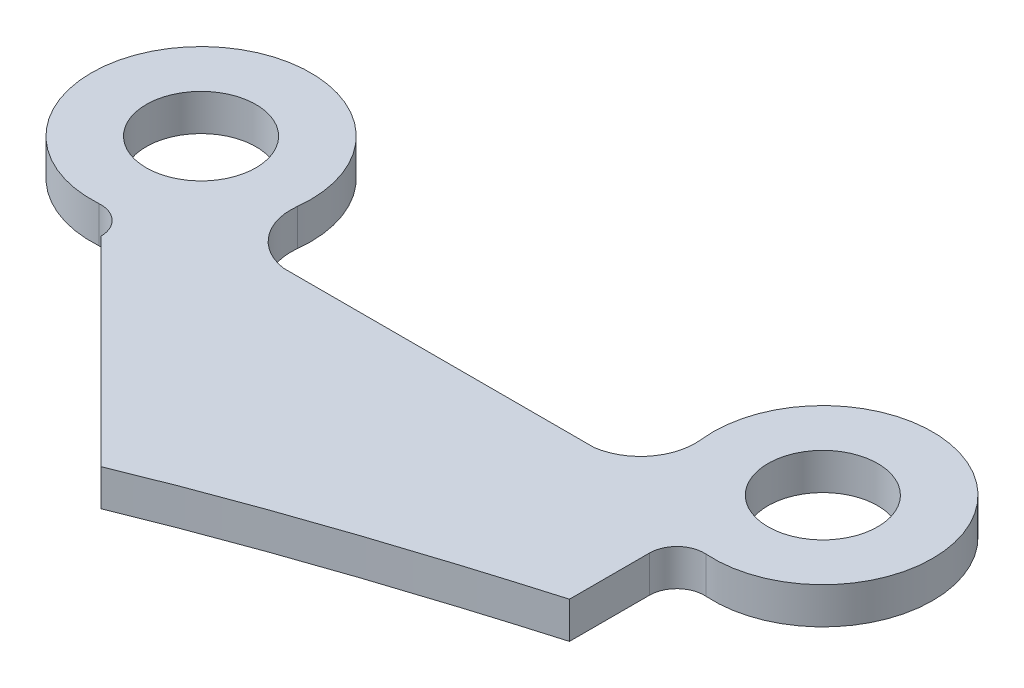
ISO-10303-21;
HEADER;
FILE_DESCRIPTION(('STEP AP214'),'2;1');
FILE_NAME('part.step','',(''),(''),'','','');
FILE_SCHEMA(('AUTOMOTIVE_DESIGN { 1 0 10303 214 1 1 1 1 }'));
ENDSEC;
DATA;
#1=APPLICATION_CONTEXT('core data for automotive mechanical design processes');
#2=APPLICATION_PROTOCOL_DEFINITION('international standard','automotive_design',2000,#1);
#3=PRODUCT_CONTEXT('',#1,'mechanical');
#4=PRODUCT('Part','Part','',(#3));
#5=PRODUCT_RELATED_PRODUCT_CATEGORY('part','',(#4));
#6=PRODUCT_DEFINITION_FORMATION('','',#4);
#7=PRODUCT_DEFINITION_CONTEXT('part definition',#1,'design');
#8=PRODUCT_DEFINITION('design','',#6,#7);
#9=PRODUCT_DEFINITION_SHAPE('','',#8);
#10=(LENGTH_UNIT() NAMED_UNIT(*) SI_UNIT(.MILLI.,.METRE.));
#11=(NAMED_UNIT(*) PLANE_ANGLE_UNIT() SI_UNIT($,.RADIAN.));
#12=(NAMED_UNIT(*) SI_UNIT($,.STERADIAN.) SOLID_ANGLE_UNIT());
#13=UNCERTAINTY_MEASURE_WITH_UNIT(LENGTH_MEASURE(1.E-05),#10,'distance_accuracy_value','');
#14=(GEOMETRIC_REPRESENTATION_CONTEXT(3) GLOBAL_UNCERTAINTY_ASSIGNED_CONTEXT((#13)) GLOBAL_UNIT_ASSIGNED_CONTEXT((#10,
#11,#12)) REPRESENTATION_CONTEXT('',''));
#15=CARTESIAN_POINT('',(0.,0.,0.));
#16=DIRECTION('',(0.,0.,1.));
#17=DIRECTION('',(1.,0.,0.));
#18=AXIS2_PLACEMENT_3D('',#15,#16,#17);
#19=CARTESIAN_POINT('',(1003.5,-336.43981096134,-430.79991693377));
#20=DIRECTION('',(0.,-1.,0.));
#21=DIRECTION('',(0.,0.,1.));
#22=AXIS2_PLACEMENT_3D('',#19,#20,#21);
#23=PLANE('',#22);
#24=CARTESIAN_POINT('',(1003.,-336.43981096134,-438.283231707318));
#25=DIRECTION('',(0.,1.,0.));
#26=DIRECTION('',(0.,0.,1.));
#27=AXIS2_PLACEMENT_3D('',#24,#25,#26);
#28=CIRCLE('',#27,2.99999999999994);
#29=CARTESIAN_POINT('',(1003.,-336.43981096134,-435.283231707318));
#30=VERTEX_POINT('',#29);
#31=EDGE_CURVE('E190',#30,#30,#28,.T.);
#32=ORIENTED_EDGE('',*,*,#31,.T.);
#33=EDGE_LOOP('',(#32));
#34=FACE_BOUND('',#33,.T.);
#35=CARTESIAN_POINT('',(1003.5,-336.43981096134,-430.79991693377));
#36=DIRECTION('',(0.,1.,0.));
#37=DIRECTION('',(0.,0.,1.));
#38=AXIS2_PLACEMENT_3D('',#35,#36,#37);
#39=CIRCLE('',#38,1.5);
#40=CARTESIAN_POINT('',(1005.,-336.43981096134,-430.79991693377));
#41=VERTEX_POINT('',#40);
#42=CARTESIAN_POINT('',(1003.4,-336.43981096134,-432.29657988848));
#43=VERTEX_POINT('',#42);
#44=EDGE_CURVE('E177',#41,#43,#39,.T.);
#45=ORIENTED_EDGE('',*,*,#44,.T.);
#46=CARTESIAN_POINT('',(1003.,-336.43981096134,-438.283231707318));
#47=DIRECTION('',(0.,1.,0.));
#48=DIRECTION('',(0.,0.,1.));
#49=AXIS2_PLACEMENT_3D('',#46,#47,#48);
#50=CIRCLE('',#49,6.00000000000004);
#51=CARTESIAN_POINT('',(1008.96038354779,-336.43981096134,-437.594880079705));
#52=VERTEX_POINT('',#51);
#53=EDGE_CURVE('E174',#52,#43,#50,.T.);
#54=ORIENTED_EDGE('',*,*,#53,.F.);
#55=CARTESIAN_POINT('',(1011.94057532168,-336.43981096134,-437.250704265898));
#56=DIRECTION('',(0.,1.,0.));
#57=DIRECTION('',(0.,0.,1.));
#58=AXIS2_PLACEMENT_3D('',#55,#56,#57);
#59=CIRCLE('',#58,2.99999999999996);
#60=CARTESIAN_POINT('',(1011.5,-336.43981096134,-434.283231707318));
#61=VERTEX_POINT('',#60);
#62=EDGE_CURVE('E170',#52,#61,#59,.T.);
#63=ORIENTED_EDGE('',*,*,#62,.T.);
#64=DIRECTION('',(-1.,0.,0.));
#65=VECTOR('',#64,1.);
#66=CARTESIAN_POINT('',(1028.5,-336.43981096134,-434.283231707318));
#67=LINE('',#66,#65);
#68=CARTESIAN_POINT('',(1028.5,-336.43981096134,-434.283231707318));
#69=VERTEX_POINT('',#68);
#70=EDGE_CURVE('E166',#69,#61,#67,.T.);
#71=ORIENTED_EDGE('',*,*,#70,.F.);
#72=CARTESIAN_POINT('',(1028.05942467832,-336.43981096134,-437.250704265898));
#73=DIRECTION('',(0.,1.,0.));
#74=DIRECTION('',(0.,0.,1.));
#75=AXIS2_PLACEMENT_3D('',#72,#73,#74);
#76=CIRCLE('',#75,2.99999999999996);
#77=CARTESIAN_POINT('',(1031.03961645221,-336.43981096134,-437.594880079705));
#78=VERTEX_POINT('',#77);
#79=EDGE_CURVE('E162',#69,#78,#76,.T.);
#80=ORIENTED_EDGE('',*,*,#79,.T.);
#81=CARTESIAN_POINT('',(1037.,-336.43981096134,-438.283231707318));
#82=DIRECTION('',(0.,1.,0.));
#83=DIRECTION('',(0.,0.,1.));
#84=AXIS2_PLACEMENT_3D('',#81,#82,#83);
#85=CIRCLE('',#84,5.99999999999999);
#86=CARTESIAN_POINT('',(1036.6,-336.43981096134,-432.29657988848));
#87=VERTEX_POINT('',#86);
#88=EDGE_CURVE('E143',#87,#78,#85,.T.);
#89=ORIENTED_EDGE('',*,*,#88,.F.);
#90=CARTESIAN_POINT('',(1036.5,-336.43981096134,-430.79991693377));
#91=DIRECTION('',(0.,1.,0.));
#92=DIRECTION('',(0.,0.,1.));
#93=AXIS2_PLACEMENT_3D('',#90,#91,#92);
#94=CIRCLE('',#93,1.50000000000005);
#95=CARTESIAN_POINT('',(1035.,-336.43981096134,-430.79991693377));
#96=VERTEX_POINT('',#95);
#97=EDGE_CURVE('E141',#87,#96,#94,.T.);
#98=ORIENTED_EDGE('',*,*,#97,.T.);
#99=DIRECTION('',(0.,0.,-1.));
#100=VECTOR('',#99,1.);
#101=CARTESIAN_POINT('',(1035.,-336.43981096134,-430.712849211409));
#102=LINE('',#101,#100);
#103=CARTESIAN_POINT('',(1034.99999999986,-336.43981096134,-426.4272406204));
#104=VERTEX_POINT('',#103);
#105=EDGE_CURVE('E123',#104,#96,#102,.T.);
#106=ORIENTED_EDGE('',*,*,#105,.F.);
#107=CARTESIAN_POINT('',(1015.90379797933,-336.43981096134,-419.896118954461));
#108=CARTESIAN_POINT('',(1021.18574672281,-336.43981096134,-422.066519939314));
#109=CARTESIAN_POINT('',(1027.58904483357,-336.43981096134,-424.27172398807));
#110=CARTESIAN_POINT('',(1034.99999999986,-336.43981096134,-426.4272406204));
#111=(BOUNDED_CURVE() B_SPLINE_CURVE(3,(#107,#108,#109,#110),.UNSPECIFIED.,.F.,
.F.) B_SPLINE_CURVE_WITH_KNOTS((4,4),(0.141934854100476,0.193423321701997),
.UNSPECIFIED.) CURVE() GEOMETRIC_REPRESENTATION_ITEM() RATIONAL_B_SPLINE_CURVE((0.593424606066283,
0.56374935932761,0.54114361204481,0.525607364217886)) REPRESENTATION_ITEM(''));
#112=CARTESIAN_POINT('',(1015.90379797932,-336.43981096134,-419.896118954459));
#113=VERTEX_POINT('',#112);
#114=EDGE_CURVE('E132',#113,#104,#111,.T.);
#115=ORIENTED_EDGE('',*,*,#114,.F.);
#116=DIRECTION('',(0.707106781186916,0.,0.707106781186179));
#117=VECTOR('',#116,1.);
#118=CARTESIAN_POINT('',(1005.,-336.43981096134,-430.79991693377));
#119=LINE('',#118,#117);
#120=EDGE_CURVE('E135',#41,#113,#119,.T.);
#121=ORIENTED_EDGE('',*,*,#120,.F.);
#122=EDGE_LOOP('',(#45,#54,#63,#71,#80,#89,#98,#106,#115,#121));
#123=FACE_BOUND('',#122,.T.);
#124=CARTESIAN_POINT('',(1037.,-336.43981096134,-438.283231707318));
#125=DIRECTION('',(0.,1.,0.));
#126=DIRECTION('',(0.,0.,1.));
#127=AXIS2_PLACEMENT_3D('',#124,#125,#126);
#128=CIRCLE('',#127,2.99999999999994);
#129=CARTESIAN_POINT('',(1037.,-336.43981096134,-435.283231707318));
#130=VERTEX_POINT('',#129);
#131=EDGE_CURVE('E293',#130,#130,#128,.T.);
#132=ORIENTED_EDGE('',*,*,#131,.T.);
#133=EDGE_LOOP('',(#132));
#134=FACE_BOUND('',#133,.T.);
#135=ADVANCED_FACE('F40',(#34,#123,#134),#23,.T.);
#136=CARTESIAN_POINT('',(1003.5,-334.43981096134,-430.79991693377));
#137=DIRECTION('',(0.,-1.,0.));
#138=DIRECTION('',(0.,0.,1.));
#139=AXIS2_PLACEMENT_3D('',#136,#137,#138);
#140=PLANE('',#139);
#141=CARTESIAN_POINT('',(1003.5,-334.43981096134,-430.79991693377));
#142=DIRECTION('',(0.,1.,0.));
#143=DIRECTION('',(0.,0.,1.));
#144=AXIS2_PLACEMENT_3D('',#141,#142,#143);
#145=CIRCLE('',#144,1.5);
#146=CARTESIAN_POINT('',(1005.,-334.43981096134,-430.79991693377));
#147=VERTEX_POINT('',#146);
#148=CARTESIAN_POINT('',(1003.4,-334.43981096134,-432.29657988848));
#149=VERTEX_POINT('',#148);
#150=EDGE_CURVE('E187',#147,#149,#145,.T.);
#151=ORIENTED_EDGE('',*,*,#150,.F.);
#152=DIRECTION('',(0.707106781186916,0.,0.707106781186179));
#153=VECTOR('',#152,1.);
#154=CARTESIAN_POINT('',(1005.,-334.43981096134,-430.79991693377));
#155=LINE('',#154,#153);
#156=CARTESIAN_POINT('',(1015.90379797932,-334.43981096134,-419.896118954459));
#157=VERTEX_POINT('',#156);
#158=EDGE_CURVE('E180',#147,#157,#155,.T.);
#159=ORIENTED_EDGE('',*,*,#158,.T.);
#160=CARTESIAN_POINT('',(1015.90379797933,-334.43981096134,-419.89611895446));
#161=CARTESIAN_POINT('',(1021.18574672281,-334.43981096134,-422.066519939314));
#162=CARTESIAN_POINT('',(1027.58904483357,-334.43981096134,-424.27172398807));
#163=CARTESIAN_POINT('',(1034.99999999986,-334.43981096134,-426.4272406204));
#164=(BOUNDED_CURVE() B_SPLINE_CURVE(3,(#160,#161,#162,#163),.UNSPECIFIED.,.F.,
.F.) B_SPLINE_CURVE_WITH_KNOTS((4,4),(0.141934854100476,0.193423321701997),
.UNSPECIFIED.) CURVE() GEOMETRIC_REPRESENTATION_ITEM() RATIONAL_B_SPLINE_CURVE((0.593424606066283,
0.56374935932761,0.54114361204481,0.525607364217886)) REPRESENTATION_ITEM(''));
#165=CARTESIAN_POINT('',(1034.99999999986,-334.43981096134,-426.4272406204));
#166=VERTEX_POINT('',#165);
#167=EDGE_CURVE('E209',#157,#166,#164,.T.);
#168=ORIENTED_EDGE('',*,*,#167,.T.);
#169=DIRECTION('',(0.,0.,1.));
#170=VECTOR('',#169,1.);
#171=CARTESIAN_POINT('',(1035.,-334.43981096134,-430.712849211409));
#172=LINE('',#171,#170);
#173=CARTESIAN_POINT('',(1035.,-334.43981096134,-430.79991693377));
#174=VERTEX_POINT('',#173);
#175=EDGE_CURVE('E126',#174,#166,#172,.T.);
#176=ORIENTED_EDGE('',*,*,#175,.F.);
#177=CARTESIAN_POINT('',(1036.5,-334.43981096134,-430.79991693377));
#178=DIRECTION('',(0.,1.,0.));
#179=DIRECTION('',(0.,0.,1.));
#180=AXIS2_PLACEMENT_3D('',#177,#178,#179);
#181=CIRCLE('',#180,1.50000000000005);
#182=CARTESIAN_POINT('',(1036.6,-334.43981096134,-432.29657988848));
#183=VERTEX_POINT('',#182);
#184=EDGE_CURVE('E205',#183,#174,#181,.T.);
#185=ORIENTED_EDGE('',*,*,#184,.F.);
#186=CARTESIAN_POINT('',(1037.,-334.43981096134,-438.283231707318));
#187=DIRECTION('',(0.,1.,0.));
#188=DIRECTION('',(0.,0.,1.));
#189=AXIS2_PLACEMENT_3D('',#186,#187,#188);
#190=CIRCLE('',#189,5.99999999999999);
#191=CARTESIAN_POINT('',(1031.03961645221,-334.43981096134,-437.594880079705));
#192=VERTEX_POINT('',#191);
#193=EDGE_CURVE('E202',#183,#192,#190,.T.);
#194=ORIENTED_EDGE('',*,*,#193,.T.);
#195=CARTESIAN_POINT('',(1028.05942467832,-334.43981096134,-437.250704265898));
#196=DIRECTION('',(0.,1.,0.));
#197=DIRECTION('',(0.,0.,1.));
#198=AXIS2_PLACEMENT_3D('',#195,#196,#197);
#199=CIRCLE('',#198,2.99999999999996);
#200=CARTESIAN_POINT('',(1028.5,-334.43981096134,-434.283231707318));
#201=VERTEX_POINT('',#200);
#202=EDGE_CURVE('E199',#201,#192,#199,.T.);
#203=ORIENTED_EDGE('',*,*,#202,.F.);
#204=DIRECTION('',(-1.,0.,0.));
#205=VECTOR('',#204,1.);
#206=CARTESIAN_POINT('',(1028.5,-334.43981096134,-434.283231707318));
#207=LINE('',#206,#205);
#208=CARTESIAN_POINT('',(1011.5,-334.43981096134,-434.283231707318));
#209=VERTEX_POINT('',#208);
#210=EDGE_CURVE('E196',#201,#209,#207,.T.);
#211=ORIENTED_EDGE('',*,*,#210,.T.);
#212=CARTESIAN_POINT('',(1011.94057532168,-334.43981096134,-437.250704265898));
#213=DIRECTION('',(0.,1.,0.));
#214=DIRECTION('',(0.,0.,1.));
#215=AXIS2_PLACEMENT_3D('',#212,#213,#214);
#216=CIRCLE('',#215,2.99999999999996);
#217=CARTESIAN_POINT('',(1008.96038354779,-334.43981096134,-437.594880079705));
#218=VERTEX_POINT('',#217);
#219=EDGE_CURVE('E193',#218,#209,#216,.T.);
#220=ORIENTED_EDGE('',*,*,#219,.F.);
#221=CARTESIAN_POINT('',(1003.,-334.43981096134,-438.283231707318));
#222=DIRECTION('',(0.,1.,0.));
#223=DIRECTION('',(0.,0.,1.));
#224=AXIS2_PLACEMENT_3D('',#221,#222,#223);
#225=CIRCLE('',#224,6.00000000000004);
#226=EDGE_CURVE('E189',#218,#149,#225,.T.);
#227=ORIENTED_EDGE('',*,*,#226,.T.);
#228=EDGE_LOOP('',(#151,#159,#168,#176,#185,#194,#203,#211,#220,#227));
#229=FACE_BOUND('',#228,.T.);
#230=CARTESIAN_POINT('',(1003.,-334.43981096134,-438.283231707318));
#231=DIRECTION('',(0.,1.,0.));
#232=DIRECTION('',(0.,0.,1.));
#233=AXIS2_PLACEMENT_3D('',#230,#231,#232);
#234=CIRCLE('',#233,2.99999999999994);
#235=CARTESIAN_POINT('',(1003.,-334.43981096134,-435.283231707318));
#236=VERTEX_POINT('',#235);
#237=EDGE_CURVE('E181',#236,#236,#234,.T.);
#238=ORIENTED_EDGE('',*,*,#237,.F.);
#239=EDGE_LOOP('',(#238));
#240=FACE_BOUND('',#239,.T.);
#241=CARTESIAN_POINT('',(1037.,-334.43981096134,-438.283231707318));
#242=DIRECTION('',(0.,1.,0.));
#243=DIRECTION('',(0.,0.,1.));
#244=AXIS2_PLACEMENT_3D('',#241,#242,#243);
#245=CIRCLE('',#244,2.99999999999994);
#246=CARTESIAN_POINT('',(1037.,-334.43981096134,-435.283231707318));
#247=VERTEX_POINT('',#246);
#248=EDGE_CURVE('E295',#247,#247,#245,.T.);
#249=ORIENTED_EDGE('',*,*,#248,.F.);
#250=EDGE_LOOP('',(#249));
#251=FACE_BOUND('',#250,.T.);
#252=ADVANCED_FACE('F237',(#229,#240,#251),#140,.F.);
#253=CARTESIAN_POINT('',(1003.5,-336.43981096134,-430.79991693377));
#254=DIRECTION('',(0.,1.,0.));
#255=DIRECTION('',(0.,0.,-1.));
#256=AXIS2_PLACEMENT_3D('',#253,#254,#255);
#257=CYLINDRICAL_SURFACE('',#256,1.5);
#258=ORIENTED_EDGE('',*,*,#150,.T.);
#259=DIRECTION('',(0.,1.,0.));
#260=VECTOR('',#259,1.);
#261=CARTESIAN_POINT('',(1003.4,-336.43981096134,-432.29657988848));
#262=LINE('',#261,#260);
#263=EDGE_CURVE('E44',#43,#149,#262,.T.);
#264=ORIENTED_EDGE('',*,*,#263,.F.);
#265=ORIENTED_EDGE('',*,*,#44,.F.);
#266=DIRECTION('',(0.,1.,0.));
#267=VECTOR('',#266,1.);
#268=CARTESIAN_POINT('',(1005.,-336.43981096134,-430.79991693377));
#269=LINE('',#268,#267);
#270=EDGE_CURVE('E12',#41,#147,#269,.T.);
#271=ORIENTED_EDGE('',*,*,#270,.T.);
#272=EDGE_LOOP('',(#258,#264,#265,#271));
#273=FACE_BOUND('',#272,.T.);
#274=ADVANCED_FACE('F42',(#273),#257,.F.);
#275=CARTESIAN_POINT('',(1005.,-336.43981096134,-430.79991693377));
#276=DIRECTION('',(0.707106781186179,0.,-0.707106781186916));
#277=DIRECTION('',(0.707106781186916,0.,0.707106781186179));
#278=AXIS2_PLACEMENT_3D('',#275,#276,#277);
#279=PLANE('',#278);
#280=ORIENTED_EDGE('',*,*,#158,.F.);
#281=ORIENTED_EDGE('',*,*,#270,.F.);
#282=ORIENTED_EDGE('',*,*,#120,.T.);
#283=DIRECTION('',(0.,1.,0.));
#284=VECTOR('',#283,1.);
#285=CARTESIAN_POINT('',(1015.90379797932,-336.43981096134,-419.896118954459));
#286=LINE('',#285,#284);
#287=EDGE_CURVE('E50',#113,#157,#286,.T.);
#288=ORIENTED_EDGE('',*,*,#287,.T.);
#289=EDGE_LOOP('',(#280,#281,#282,#288));
#290=FACE_BOUND('',#289,.T.);
#291=ADVANCED_FACE('F240',(#290),#279,.F.);
#292=DIRECTION('',(0.,1.,0.));
#293=VECTOR('',#292,1.);
#294=SURFACE_OF_LINEAR_EXTRUSION('',#111,#293);
#295=ORIENTED_EDGE('',*,*,#167,.F.);
#296=ORIENTED_EDGE('',*,*,#287,.F.);
#297=ORIENTED_EDGE('',*,*,#114,.T.);
#298=DIRECTION('',(0.,1.,0.));
#299=VECTOR('',#298,1.);
#300=CARTESIAN_POINT('',(1034.99999999986,-336.43981096134,-426.4272406204));
#301=LINE('',#300,#299);
#302=EDGE_CURVE('E119',#104,#166,#301,.T.);
#303=ORIENTED_EDGE('',*,*,#302,.T.);
#304=EDGE_LOOP('',(#295,#296,#297,#303));
#305=FACE_BOUND('',#304,.T.);
#306=ADVANCED_FACE('F133',(#305),#294,.T.);
#307=CARTESIAN_POINT('',(1035.,-336.43981096134,-430.712849211409));
#308=DIRECTION('',(1.,0.,0.));
#309=DIRECTION('',(0.,0.,1.));
#310=AXIS2_PLACEMENT_3D('',#307,#308,#309);
#311=PLANE('',#310);
#312=ORIENTED_EDGE('',*,*,#175,.T.);
#313=ORIENTED_EDGE('',*,*,#302,.F.);
#314=ORIENTED_EDGE('',*,*,#105,.T.);
#315=DIRECTION('',(0.,1.,0.));
#316=VECTOR('',#315,1.);
#317=CARTESIAN_POINT('',(1035.,-336.43981096134,-430.79991693377));
#318=LINE('',#317,#316);
#319=EDGE_CURVE('E129',#96,#174,#318,.T.);
#320=ORIENTED_EDGE('',*,*,#319,.T.);
#321=EDGE_LOOP('',(#312,#313,#314,#320));
#322=FACE_BOUND('',#321,.T.);
#323=ADVANCED_FACE('F121',(#322),#311,.T.);
#324=CARTESIAN_POINT('',(1036.5,-336.43981096134,-430.79991693377));
#325=DIRECTION('',(0.,1.,0.));
#326=DIRECTION('',(0.,0.,-1.));
#327=AXIS2_PLACEMENT_3D('',#324,#325,#326);
#328=CYLINDRICAL_SURFACE('',#327,1.50000000000005);
#329=ORIENTED_EDGE('',*,*,#184,.T.);
#330=ORIENTED_EDGE('',*,*,#319,.F.);
#331=ORIENTED_EDGE('',*,*,#97,.F.);
#332=DIRECTION('',(0.,1.,0.));
#333=VECTOR('',#332,1.);
#334=CARTESIAN_POINT('',(1036.6,-336.43981096134,-432.29657988848));
#335=LINE('',#334,#333);
#336=EDGE_CURVE('E220',#87,#183,#335,.T.);
#337=ORIENTED_EDGE('',*,*,#336,.T.);
#338=EDGE_LOOP('',(#329,#330,#331,#337));
#339=FACE_BOUND('',#338,.T.);
#340=ADVANCED_FACE('F261',(#339),#328,.F.);
#341=CARTESIAN_POINT('',(1037.,-336.43981096134,-438.283231707318));
#342=DIRECTION('',(0.,1.,0.));
#343=DIRECTION('',(0.,0.,-1.));
#344=AXIS2_PLACEMENT_3D('',#341,#342,#343);
#345=CYLINDRICAL_SURFACE('',#344,5.99999999999999);
#346=ORIENTED_EDGE('',*,*,#193,.F.);
#347=ORIENTED_EDGE('',*,*,#336,.F.);
#348=ORIENTED_EDGE('',*,*,#88,.T.);
#349=DIRECTION('',(0.,1.,0.));
#350=VECTOR('',#349,1.);
#351=CARTESIAN_POINT('',(1031.03961645221,-336.43981096134,-437.594880079705));
#352=LINE('',#351,#350);
#353=EDGE_CURVE('E222',#78,#192,#352,.T.);
#354=ORIENTED_EDGE('',*,*,#353,.T.);
#355=EDGE_LOOP('',(#346,#347,#348,#354));
#356=FACE_BOUND('',#355,.T.);
#357=ADVANCED_FACE('F264',(#356),#345,.T.);
#358=CARTESIAN_POINT('',(1028.05942467832,-336.43981096134,-437.250704265898));
#359=DIRECTION('',(0.,1.,0.));
#360=DIRECTION('',(0.,0.,-1.));
#361=AXIS2_PLACEMENT_3D('',#358,#359,#360);
#362=CYLINDRICAL_SURFACE('',#361,2.99999999999996);
#363=ORIENTED_EDGE('',*,*,#202,.T.);
#364=ORIENTED_EDGE('',*,*,#353,.F.);
#365=ORIENTED_EDGE('',*,*,#79,.F.);
#366=DIRECTION('',(0.,1.,0.));
#367=VECTOR('',#366,1.);
#368=CARTESIAN_POINT('',(1028.5,-336.43981096134,-434.283231707318));
#369=LINE('',#368,#367);
#370=EDGE_CURVE('E224',#69,#201,#369,.T.);
#371=ORIENTED_EDGE('',*,*,#370,.T.);
#372=EDGE_LOOP('',(#363,#364,#365,#371));
#373=FACE_BOUND('',#372,.T.);
#374=ADVANCED_FACE('F268',(#373),#362,.F.);
#375=CARTESIAN_POINT('',(1028.5,-336.43981096134,-434.283231707318));
#376=DIRECTION('',(0.,0.,1.));
#377=DIRECTION('',(0.,1.,0.));
#378=AXIS2_PLACEMENT_3D('',#375,#376,#377);
#379=PLANE('',#378);
#380=ORIENTED_EDGE('',*,*,#210,.F.);
#381=ORIENTED_EDGE('',*,*,#370,.F.);
#382=ORIENTED_EDGE('',*,*,#70,.T.);
#383=DIRECTION('',(0.,1.,0.));
#384=VECTOR('',#383,1.);
#385=CARTESIAN_POINT('',(1011.5,-336.43981096134,-434.283231707318));
#386=LINE('',#385,#384);
#387=EDGE_CURVE('E226',#61,#209,#386,.T.);
#388=ORIENTED_EDGE('',*,*,#387,.T.);
#389=EDGE_LOOP('',(#380,#381,#382,#388));
#390=FACE_BOUND('',#389,.T.);
#391=ADVANCED_FACE('F272',(#390),#379,.F.);
#392=CARTESIAN_POINT('',(1011.94057532168,-336.43981096134,-437.250704265898));
#393=DIRECTION('',(0.,1.,0.));
#394=DIRECTION('',(0.,0.,-1.));
#395=AXIS2_PLACEMENT_3D('',#392,#393,#394);
#396=CYLINDRICAL_SURFACE('',#395,2.99999999999996);
#397=ORIENTED_EDGE('',*,*,#219,.T.);
#398=ORIENTED_EDGE('',*,*,#387,.F.);
#399=ORIENTED_EDGE('',*,*,#62,.F.);
#400=DIRECTION('',(0.,1.,0.));
#401=VECTOR('',#400,1.);
#402=CARTESIAN_POINT('',(1008.96038354779,-336.43981096134,-437.594880079705));
#403=LINE('',#402,#401);
#404=EDGE_CURVE('E227',#52,#218,#403,.T.);
#405=ORIENTED_EDGE('',*,*,#404,.T.);
#406=EDGE_LOOP('',(#397,#398,#399,#405));
#407=FACE_BOUND('',#406,.T.);
#408=ADVANCED_FACE('F276',(#407),#396,.F.);
#409=CARTESIAN_POINT('',(1003.,-336.43981096134,-438.283231707318));
#410=DIRECTION('',(0.,1.,0.));
#411=DIRECTION('',(0.,0.,-1.));
#412=AXIS2_PLACEMENT_3D('',#409,#410,#411);
#413=CYLINDRICAL_SURFACE('',#412,6.00000000000004);
#414=ORIENTED_EDGE('',*,*,#226,.F.);
#415=ORIENTED_EDGE('',*,*,#404,.F.);
#416=ORIENTED_EDGE('',*,*,#53,.T.);
#417=ORIENTED_EDGE('',*,*,#263,.T.);
#418=EDGE_LOOP('',(#414,#415,#416,#417));
#419=FACE_BOUND('',#418,.T.);
#420=ADVANCED_FACE('F232',(#419),#413,.T.);
#421=CARTESIAN_POINT('',(1003.,-336.43981096134,-438.283231707318));
#422=DIRECTION('',(0.,1.,0.));
#423=DIRECTION('',(0.,0.,-1.));
#424=AXIS2_PLACEMENT_3D('',#421,#422,#423);
#425=CYLINDRICAL_SURFACE('',#424,2.99999999999994);
#426=ORIENTED_EDGE('',*,*,#31,.F.);
#427=EDGE_LOOP('',(#426));
#428=FACE_BOUND('',#427,.T.);
#429=ORIENTED_EDGE('',*,*,#237,.T.);
#430=EDGE_LOOP('',(#429));
#431=FACE_BOUND('',#430,.T.);
#432=ADVANCED_FACE('F254',(#428,#431),#425,.F.);
#433=CARTESIAN_POINT('',(1037.,-336.43981096134,-438.283231707318));
#434=DIRECTION('',(0.,1.,0.));
#435=DIRECTION('',(0.,0.,-1.));
#436=AXIS2_PLACEMENT_3D('',#433,#434,#435);
#437=CYLINDRICAL_SURFACE('',#436,2.99999999999994);
#438=ORIENTED_EDGE('',*,*,#131,.F.);
#439=EDGE_LOOP('',(#438));
#440=FACE_BOUND('',#439,.T.);
#441=ORIENTED_EDGE('',*,*,#248,.T.);
#442=EDGE_LOOP('',(#441));
#443=FACE_BOUND('',#442,.T.);
#444=ADVANCED_FACE('F283',(#440,#443),#437,.F.);
#445=CLOSED_SHELL('',(#135,#252,#274,#291,#306,#323,#340,#357,#374,#391,#408,#420,#432,#444));
#446=MANIFOLD_SOLID_BREP('B2',#445);
#447=ADVANCED_BREP_SHAPE_REPRESENTATION('',(#18,#446),#14);
#448=SHAPE_DEFINITION_REPRESENTATION(#9,#447);
ENDSEC;
END-ISO-10303-21;
